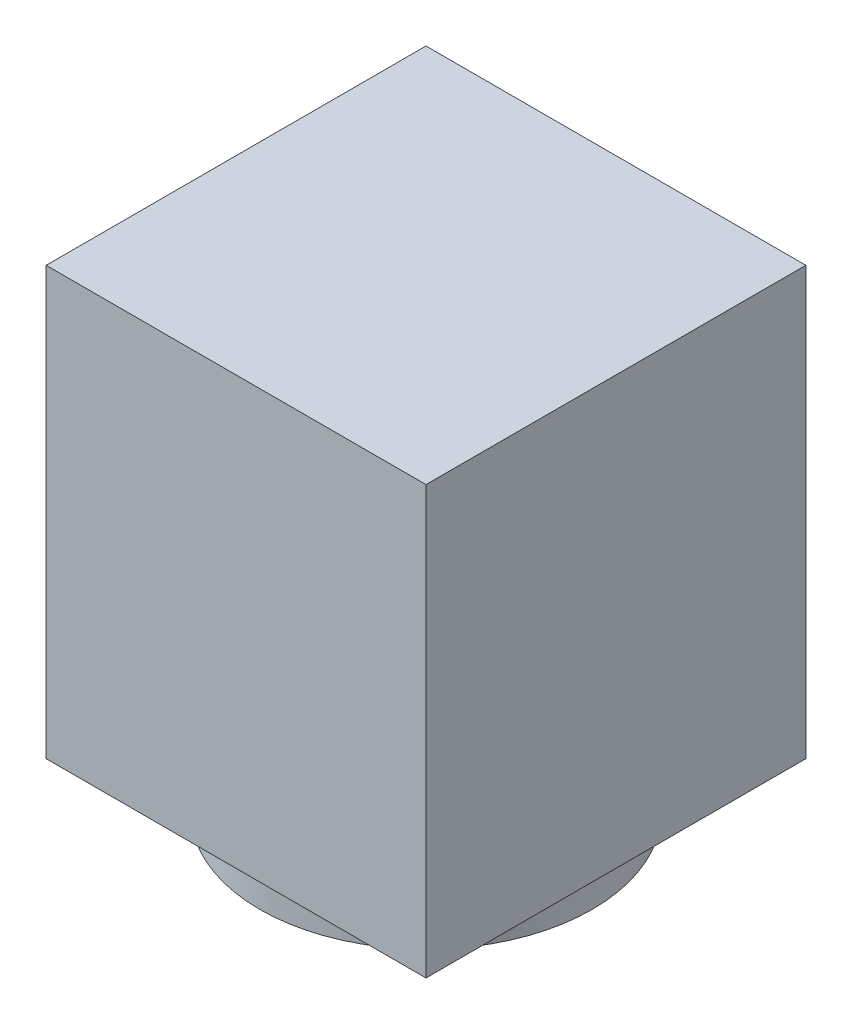
ISO-10303-21;
HEADER;
FILE_DESCRIPTION(('STEP AP214'),'2;1');
FILE_NAME('part.step','',(''),(''),'','','');
FILE_SCHEMA(('AUTOMOTIVE_DESIGN { 1 0 10303 214 1 1 1 1 }'));
ENDSEC;
DATA;
#1=APPLICATION_CONTEXT('core data for automotive mechanical design processes');
#2=APPLICATION_PROTOCOL_DEFINITION('international standard','automotive_design',2000,#1);
#3=PRODUCT_CONTEXT('',#1,'mechanical');
#4=PRODUCT('Part','Part','',(#3));
#5=PRODUCT_RELATED_PRODUCT_CATEGORY('part','',(#4));
#6=PRODUCT_DEFINITION_FORMATION('','',#4);
#7=PRODUCT_DEFINITION_CONTEXT('part definition',#1,'design');
#8=PRODUCT_DEFINITION('design','',#6,#7);
#9=PRODUCT_DEFINITION_SHAPE('','',#8);
#10=(LENGTH_UNIT() NAMED_UNIT(*) SI_UNIT(.MILLI.,.METRE.));
#11=(NAMED_UNIT(*) PLANE_ANGLE_UNIT() SI_UNIT($,.RADIAN.));
#12=(NAMED_UNIT(*) SI_UNIT($,.STERADIAN.) SOLID_ANGLE_UNIT());
#13=UNCERTAINTY_MEASURE_WITH_UNIT(LENGTH_MEASURE(1.E-05),#10,'distance_accuracy_value','');
#14=(GEOMETRIC_REPRESENTATION_CONTEXT(3) GLOBAL_UNCERTAINTY_ASSIGNED_CONTEXT((#13)) GLOBAL_UNIT_ASSIGNED_CONTEXT((#10,
#11,#12)) REPRESENTATION_CONTEXT('',''));
#15=CARTESIAN_POINT('',(0.,0.,0.));
#16=DIRECTION('',(0.,0.,1.));
#17=DIRECTION('',(1.,0.,0.));
#18=AXIS2_PLACEMENT_3D('',#15,#16,#17);
#19=CARTESIAN_POINT('',(0.,2.,0.));
#20=DIRECTION('',(0.,-1.,0.));
#21=DIRECTION('',(0.,0.,-1.));
#22=AXIS2_PLACEMENT_3D('',#19,#20,#21);
#23=CYLINDRICAL_SURFACE('',#22,7.);
#24=CARTESIAN_POINT('',(0.,2.,0.));
#25=DIRECTION('',(0.,1.,0.));
#26=DIRECTION('',(0.,0.,1.));
#27=AXIS2_PLACEMENT_3D('',#24,#25,#26);
#28=CIRCLE('',#27,7.);
#29=CARTESIAN_POINT('',(0.,2.,7.));
#30=VERTEX_POINT('',#29);
#31=EDGE_CURVE('E11',#30,#30,#28,.T.);
#32=ORIENTED_EDGE('',*,*,#31,.F.);
#33=EDGE_LOOP('',(#32));
#34=FACE_BOUND('',#33,.T.);
#35=CARTESIAN_POINT('',(0.,0.,0.));
#36=DIRECTION('',(0.,1.,0.));
#37=DIRECTION('',(0.,0.,1.));
#38=AXIS2_PLACEMENT_3D('',#35,#36,#37);
#39=CIRCLE('',#38,7.);
#40=CARTESIAN_POINT('',(0.,0.,7.));
#41=VERTEX_POINT('',#40);
#42=EDGE_CURVE('E42',#41,#41,#39,.T.);
#43=ORIENTED_EDGE('',*,*,#42,.T.);
#44=EDGE_LOOP('',(#43));
#45=FACE_BOUND('',#44,.T.);
#46=ADVANCED_FACE('F39',(#34,#45),#23,.T.);
#47=CARTESIAN_POINT('',(0.,0.,0.));
#48=DIRECTION('',(0.,1.,0.));
#49=DIRECTION('',(0.,0.,1.));
#50=AXIS2_PLACEMENT_3D('',#47,#48,#49);
#51=PLANE('',#50);
#52=ORIENTED_EDGE('',*,*,#42,.F.);
#53=EDGE_LOOP('',(#52));
#54=FACE_BOUND('',#53,.T.);
#55=ADVANCED_FACE('F131',(#54),#51,.F.);
#56=CARTESIAN_POINT('',(-8.,20.,-8.));
#57=DIRECTION('',(1.,0.,0.));
#58=DIRECTION('',(0.,0.,-1.));
#59=AXIS2_PLACEMENT_3D('',#56,#57,#58);
#60=PLANE('',#59);
#61=DIRECTION('',(0.,0.,1.));
#62=VECTOR('',#61,1.);
#63=CARTESIAN_POINT('',(-8.,2.,-8.));
#64=LINE('',#63,#62);
#65=CARTESIAN_POINT('',(-8.,2.,-8.));
#66=VERTEX_POINT('',#65);
#67=CARTESIAN_POINT('',(-7.99999999999999,2.,8.));
#68=VERTEX_POINT('',#67);
#69=EDGE_CURVE('E111',#66,#68,#64,.T.);
#70=ORIENTED_EDGE('',*,*,#69,.T.);
#71=DIRECTION('',(0.,-1.,0.));
#72=VECTOR('',#71,1.);
#73=CARTESIAN_POINT('',(-7.99999999999999,20.,8.));
#74=LINE('',#73,#72);
#75=CARTESIAN_POINT('',(-7.99999999999999,20.,8.));
#76=VERTEX_POINT('',#75);
#77=EDGE_CURVE('E100',#76,#68,#74,.T.);
#78=ORIENTED_EDGE('',*,*,#77,.F.);
#79=DIRECTION('',(0.,0.,1.));
#80=VECTOR('',#79,1.);
#81=CARTESIAN_POINT('',(-8.,20.,-8.));
#82=LINE('',#81,#80);
#83=CARTESIAN_POINT('',(-8.,20.,-8.));
#84=VERTEX_POINT('',#83);
#85=EDGE_CURVE('E92',#84,#76,#82,.T.);
#86=ORIENTED_EDGE('',*,*,#85,.F.);
#87=DIRECTION('',(0.,-1.,0.));
#88=VECTOR('',#87,1.);
#89=CARTESIAN_POINT('',(-8.,20.,-8.));
#90=LINE('',#89,#88);
#91=EDGE_CURVE('E107',#84,#66,#90,.T.);
#92=ORIENTED_EDGE('',*,*,#91,.T.);
#93=EDGE_LOOP('',(#70,#78,#86,#92));
#94=FACE_BOUND('',#93,.T.);
#95=ADVANCED_FACE('F133',(#94),#60,.F.);
#96=CARTESIAN_POINT('',(-7.99999999999999,20.,8.));
#97=DIRECTION('',(0.,0.,-1.));
#98=DIRECTION('',(-1.,0.,0.));
#99=AXIS2_PLACEMENT_3D('',#96,#97,#98);
#100=PLANE('',#99);
#101=DIRECTION('',(1.,0.,0.));
#102=VECTOR('',#101,1.);
#103=CARTESIAN_POINT('',(-7.99999999999999,2.,8.));
#104=LINE('',#103,#102);
#105=CARTESIAN_POINT('',(8.00000000000001,2.,8.));
#106=VERTEX_POINT('',#105);
#107=EDGE_CURVE('E98',#68,#106,#104,.T.);
#108=ORIENTED_EDGE('',*,*,#107,.T.);
#109=DIRECTION('',(0.,-1.,0.));
#110=VECTOR('',#109,1.);
#111=CARTESIAN_POINT('',(8.00000000000001,20.,8.));
#112=LINE('',#111,#110);
#113=CARTESIAN_POINT('',(8.00000000000001,20.,8.));
#114=VERTEX_POINT('',#113);
#115=EDGE_CURVE('E96',#114,#106,#112,.T.);
#116=ORIENTED_EDGE('',*,*,#115,.F.);
#117=DIRECTION('',(1.,0.,0.));
#118=VECTOR('',#117,1.);
#119=CARTESIAN_POINT('',(-7.99999999999999,20.,8.));
#120=LINE('',#119,#118);
#121=EDGE_CURVE('E87',#76,#114,#120,.T.);
#122=ORIENTED_EDGE('',*,*,#121,.F.);
#123=ORIENTED_EDGE('',*,*,#77,.T.);
#124=EDGE_LOOP('',(#108,#116,#122,#123));
#125=FACE_BOUND('',#124,.T.);
#126=ADVANCED_FACE('F97',(#125),#100,.F.);
#127=CARTESIAN_POINT('',(8.,20.,-8.));
#128=DIRECTION('',(-1.,0.,0.));
#129=DIRECTION('',(0.,0.,1.));
#130=AXIS2_PLACEMENT_3D('',#127,#128,#129);
#131=PLANE('',#130);
#132=DIRECTION('',(0.,0.,-1.));
#133=VECTOR('',#132,1.);
#134=CARTESIAN_POINT('',(8.,2.,-8.));
#135=LINE('',#134,#133);
#136=CARTESIAN_POINT('',(8.,2.,-8.));
#137=VERTEX_POINT('',#136);
#138=EDGE_CURVE('E73',#106,#137,#135,.T.);
#139=ORIENTED_EDGE('',*,*,#138,.T.);
#140=DIRECTION('',(0.,-1.,0.));
#141=VECTOR('',#140,1.);
#142=CARTESIAN_POINT('',(8.,20.,-8.));
#143=LINE('',#142,#141);
#144=CARTESIAN_POINT('',(8.,20.,-8.));
#145=VERTEX_POINT('',#144);
#146=EDGE_CURVE('E101',#145,#137,#143,.T.);
#147=ORIENTED_EDGE('',*,*,#146,.F.);
#148=DIRECTION('',(0.,0.,-1.));
#149=VECTOR('',#148,1.);
#150=CARTESIAN_POINT('',(8.,20.,-8.));
#151=LINE('',#150,#149);
#152=EDGE_CURVE('E90',#114,#145,#151,.T.);
#153=ORIENTED_EDGE('',*,*,#152,.F.);
#154=ORIENTED_EDGE('',*,*,#115,.T.);
#155=EDGE_LOOP('',(#139,#147,#153,#154));
#156=FACE_BOUND('',#155,.T.);
#157=ADVANCED_FACE('F103',(#156),#131,.F.);
#158=CARTESIAN_POINT('',(-8.,20.,-8.));
#159=DIRECTION('',(0.,0.,1.));
#160=DIRECTION('',(1.,0.,0.));
#161=AXIS2_PLACEMENT_3D('',#158,#159,#160);
#162=PLANE('',#161);
#163=DIRECTION('',(-1.,0.,0.));
#164=VECTOR('',#163,1.);
#165=CARTESIAN_POINT('',(-8.,2.,-8.));
#166=LINE('',#165,#164);
#167=EDGE_CURVE('E79',#137,#66,#166,.T.);
#168=ORIENTED_EDGE('',*,*,#167,.T.);
#169=ORIENTED_EDGE('',*,*,#91,.F.);
#170=DIRECTION('',(-1.,0.,0.));
#171=VECTOR('',#170,1.);
#172=CARTESIAN_POINT('',(-8.,20.,-8.));
#173=LINE('',#172,#171);
#174=EDGE_CURVE('E56',#145,#84,#173,.T.);
#175=ORIENTED_EDGE('',*,*,#174,.F.);
#176=ORIENTED_EDGE('',*,*,#146,.T.);
#177=EDGE_LOOP('',(#168,#169,#175,#176));
#178=FACE_BOUND('',#177,.T.);
#179=ADVANCED_FACE('F146',(#178),#162,.F.);
#180=CARTESIAN_POINT('',(0.,20.,0.));
#181=DIRECTION('',(0.,1.,0.));
#182=DIRECTION('',(0.,0.,1.));
#183=AXIS2_PLACEMENT_3D('',#180,#181,#182);
#184=PLANE('',#183);
#185=ORIENTED_EDGE('',*,*,#85,.T.);
#186=ORIENTED_EDGE('',*,*,#121,.T.);
#187=ORIENTED_EDGE('',*,*,#152,.T.);
#188=ORIENTED_EDGE('',*,*,#174,.T.);
#189=EDGE_LOOP('',(#185,#186,#187,#188));
#190=FACE_BOUND('',#189,.T.);
#191=ADVANCED_FACE('F88',(#190),#184,.T.);
#192=CARTESIAN_POINT('',(0.,2.,0.));
#193=DIRECTION('',(0.,1.,0.));
#194=DIRECTION('',(0.,0.,1.));
#195=AXIS2_PLACEMENT_3D('',#192,#193,#194);
#196=PLANE('',#195);
#197=ORIENTED_EDGE('',*,*,#31,.T.);
#198=EDGE_LOOP('',(#197));
#199=FACE_BOUND('',#198,.T.);
#200=ORIENTED_EDGE('',*,*,#69,.F.);
#201=ORIENTED_EDGE('',*,*,#167,.F.);
#202=ORIENTED_EDGE('',*,*,#138,.F.);
#203=ORIENTED_EDGE('',*,*,#107,.F.);
#204=EDGE_LOOP('',(#200,#201,#202,#203));
#205=FACE_BOUND('',#204,.T.);
#206=ADVANCED_FACE('F149',(#199,#205),#196,.F.);
#207=CLOSED_SHELL('',(#46,#55,#95,#126,#157,#179,#191,#206));
#208=MANIFOLD_SOLID_BREP('B2',#207);
#209=ADVANCED_BREP_SHAPE_REPRESENTATION('',(#18,#208),#14);
#210=SHAPE_DEFINITION_REPRESENTATION(#9,#209);
ENDSEC;
END-ISO-10303-21;
